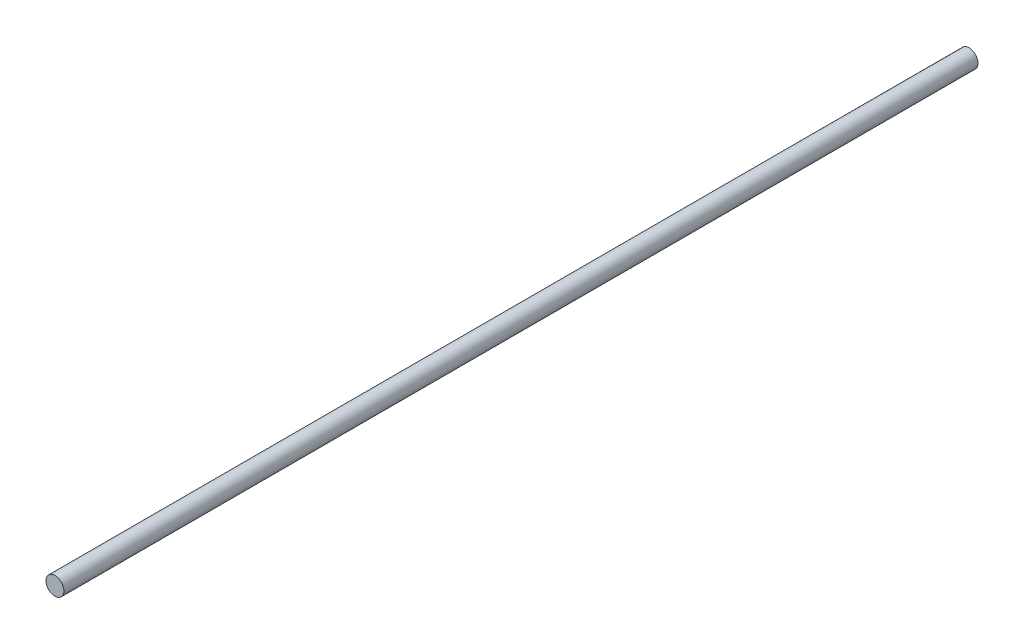
ISO-10303-21;
HEADER;
FILE_DESCRIPTION(('STEP AP214'),'2;1');
FILE_NAME('part.step','',(''),(''),'','','');
FILE_SCHEMA(('AUTOMOTIVE_DESIGN { 1 0 10303 214 1 1 1 1 }'));
ENDSEC;
DATA;
#1=APPLICATION_CONTEXT('core data for automotive mechanical design processes');
#2=APPLICATION_PROTOCOL_DEFINITION('international standard','automotive_design',2000,#1);
#3=PRODUCT_CONTEXT('',#1,'mechanical');
#4=PRODUCT('Part','Part','',(#3));
#5=PRODUCT_RELATED_PRODUCT_CATEGORY('part','',(#4));
#6=PRODUCT_DEFINITION_FORMATION('','',#4);
#7=PRODUCT_DEFINITION_CONTEXT('part definition',#1,'design');
#8=PRODUCT_DEFINITION('design','',#6,#7);
#9=PRODUCT_DEFINITION_SHAPE('','',#8);
#10=(LENGTH_UNIT() NAMED_UNIT(*) SI_UNIT(.MILLI.,.METRE.));
#11=(NAMED_UNIT(*) PLANE_ANGLE_UNIT() SI_UNIT($,.RADIAN.));
#12=(NAMED_UNIT(*) SI_UNIT($,.STERADIAN.) SOLID_ANGLE_UNIT());
#13=UNCERTAINTY_MEASURE_WITH_UNIT(LENGTH_MEASURE(1.E-05),#10,'distance_accuracy_value','');
#14=(GEOMETRIC_REPRESENTATION_CONTEXT(3) GLOBAL_UNCERTAINTY_ASSIGNED_CONTEXT((#13)) GLOBAL_UNIT_ASSIGNED_CONTEXT((#10,
#11,#12)) REPRESENTATION_CONTEXT('',''));
#15=CARTESIAN_POINT('',(0.,0.,0.));
#16=DIRECTION('',(0.,0.,1.));
#17=DIRECTION('',(1.,0.,0.));
#18=AXIS2_PLACEMENT_3D('',#15,#16,#17);
#19=CARTESIAN_POINT('',(0.,0.,510.));
#20=DIRECTION('',(0.,0.,-1.));
#21=DIRECTION('',(-1.,0.,0.));
#22=AXIS2_PLACEMENT_3D('',#19,#20,#21);
#23=CYLINDRICAL_SURFACE('',#22,5.);
#24=CARTESIAN_POINT('',(0.,0.,510.));
#25=DIRECTION('',(0.,0.,1.));
#26=DIRECTION('',(1.,0.,0.));
#27=AXIS2_PLACEMENT_3D('',#24,#25,#26);
#28=CIRCLE('',#27,5.);
#29=CARTESIAN_POINT('',(5.,0.,510.));
#30=VERTEX_POINT('',#29);
#31=EDGE_CURVE('E10',#30,#30,#28,.T.);
#32=ORIENTED_EDGE('',*,*,#31,.F.);
#33=EDGE_LOOP('',(#32));
#34=FACE_BOUND('',#33,.T.);
#35=CARTESIAN_POINT('',(0.,0.,0.));
#36=DIRECTION('',(0.,0.,1.));
#37=DIRECTION('',(1.,0.,0.));
#38=AXIS2_PLACEMENT_3D('',#35,#36,#37);
#39=CIRCLE('',#38,5.);
#40=CARTESIAN_POINT('',(5.,0.,0.));
#41=VERTEX_POINT('',#40);
#42=EDGE_CURVE('E40',#41,#41,#39,.T.);
#43=ORIENTED_EDGE('',*,*,#42,.T.);
#44=EDGE_LOOP('',(#43));
#45=FACE_BOUND('',#44,.T.);
#46=ADVANCED_FACE('F37',(#34,#45),#23,.T.);
#47=CARTESIAN_POINT('',(0.,0.,510.));
#48=DIRECTION('',(0.,0.,1.));
#49=DIRECTION('',(1.,0.,0.));
#50=AXIS2_PLACEMENT_3D('',#47,#48,#49);
#51=PLANE('',#50);
#52=ORIENTED_EDGE('',*,*,#31,.T.);
#53=EDGE_LOOP('',(#52));
#54=FACE_BOUND('',#53,.T.);
#55=ADVANCED_FACE('F54',(#54),#51,.T.);
#56=CARTESIAN_POINT('',(0.,0.,0.));
#57=DIRECTION('',(0.,0.,1.));
#58=DIRECTION('',(1.,0.,0.));
#59=AXIS2_PLACEMENT_3D('',#56,#57,#58);
#60=PLANE('',#59);
#61=ORIENTED_EDGE('',*,*,#42,.F.);
#62=EDGE_LOOP('',(#61));
#63=FACE_BOUND('',#62,.T.);
#64=ADVANCED_FACE('F52',(#63),#60,.F.);
#65=CLOSED_SHELL('',(#46,#55,#64));
#66=MANIFOLD_SOLID_BREP('B2',#65);
#67=ADVANCED_BREP_SHAPE_REPRESENTATION('',(#18,#66),#14);
#68=SHAPE_DEFINITION_REPRESENTATION(#9,#67);
ENDSEC;
END-ISO-10303-21;
